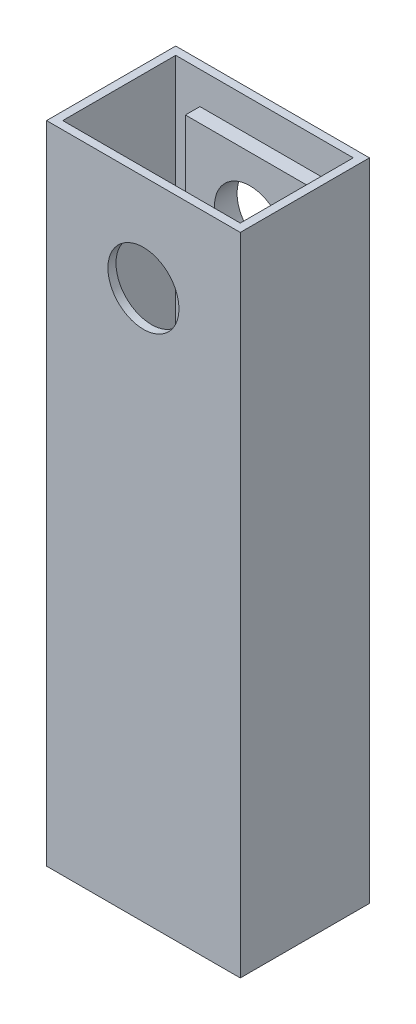
ISO-10303-21;
HEADER;
FILE_DESCRIPTION(('STEP AP214'),'2;1');
FILE_NAME('part.step','',(''),(''),'','','');
FILE_SCHEMA(('AUTOMOTIVE_DESIGN { 1 0 10303 214 1 1 1 1 }'));
ENDSEC;
DATA;
#1=APPLICATION_CONTEXT('core data for automotive mechanical design processes');
#2=APPLICATION_PROTOCOL_DEFINITION('international standard','automotive_design',2000,#1);
#3=PRODUCT_CONTEXT('',#1,'mechanical');
#4=PRODUCT('Part','Part','',(#3));
#5=PRODUCT_RELATED_PRODUCT_CATEGORY('part','',(#4));
#6=PRODUCT_DEFINITION_FORMATION('','',#4);
#7=PRODUCT_DEFINITION_CONTEXT('part definition',#1,'design');
#8=PRODUCT_DEFINITION('design','',#6,#7);
#9=PRODUCT_DEFINITION_SHAPE('','',#8);
#10=(LENGTH_UNIT() NAMED_UNIT(*) SI_UNIT(.MILLI.,.METRE.));
#11=(NAMED_UNIT(*) PLANE_ANGLE_UNIT() SI_UNIT($,.RADIAN.));
#12=(NAMED_UNIT(*) SI_UNIT($,.STERADIAN.) SOLID_ANGLE_UNIT());
#13=UNCERTAINTY_MEASURE_WITH_UNIT(LENGTH_MEASURE(1.E-05),#10,'distance_accuracy_value','');
#14=(GEOMETRIC_REPRESENTATION_CONTEXT(3) GLOBAL_UNCERTAINTY_ASSIGNED_CONTEXT((#13)) GLOBAL_UNIT_ASSIGNED_CONTEXT((#10,
#11,#12)) REPRESENTATION_CONTEXT('',''));
#15=CARTESIAN_POINT('',(0.,0.,0.));
#16=DIRECTION('',(0.,0.,1.));
#17=DIRECTION('',(1.,0.,0.));
#18=AXIS2_PLACEMENT_3D('',#15,#16,#17);
#19=CARTESIAN_POINT('',(-2.5,200.,2.5));
#20=DIRECTION('',(0.,0.,1.));
#21=DIRECTION('',(1.,0.,0.));
#22=AXIS2_PLACEMENT_3D('',#19,#20,#21);
#23=PLANE('',#22);
#24=DIRECTION('',(-1.,0.,0.));
#25=VECTOR('',#24,1.);
#26=CARTESIAN_POINT('',(-2.5,0.,2.5));
#27=LINE('',#26,#25);
#28=CARTESIAN_POINT('',(-2.5,0.,2.5));
#29=VERTEX_POINT('',#28);
#30=CARTESIAN_POINT('',(-57.5,0.,2.5));
#31=VERTEX_POINT('',#30);
#32=EDGE_CURVE('E172',#29,#31,#27,.T.);
#33=ORIENTED_EDGE('',*,*,#32,.F.);
#34=DIRECTION('',(0.,-1.,0.));
#35=VECTOR('',#34,1.);
#36=CARTESIAN_POINT('',(-2.5,200.,2.5));
#37=LINE('',#36,#35);
#38=CARTESIAN_POINT('',(-2.5,200.,2.5));
#39=VERTEX_POINT('',#38);
#40=EDGE_CURVE('E185',#39,#29,#37,.T.);
#41=ORIENTED_EDGE('',*,*,#40,.F.);
#42=DIRECTION('',(-1.,0.,0.));
#43=VECTOR('',#42,1.);
#44=CARTESIAN_POINT('',(-2.5,200.,2.5));
#45=LINE('',#44,#43);
#46=CARTESIAN_POINT('',(-57.5,200.,2.5));
#47=VERTEX_POINT('',#46);
#48=EDGE_CURVE('E162',#39,#47,#45,.T.);
#49=ORIENTED_EDGE('',*,*,#48,.T.);
#50=DIRECTION('',(0.,-1.,0.));
#51=VECTOR('',#50,1.);
#52=CARTESIAN_POINT('',(-57.5,200.,2.5));
#53=LINE('',#52,#51);
#54=EDGE_CURVE('E183',#47,#31,#53,.T.);
#55=ORIENTED_EDGE('',*,*,#54,.T.);
#56=EDGE_LOOP('',(#33,#41,#49,#55));
#57=FACE_BOUND('',#56,.T.);
#58=DIRECTION('',(1.,0.,0.));
#59=VECTOR('',#58,1.);
#60=CARTESIAN_POINT('',(-10.,150.,2.5));
#61=LINE('',#60,#59);
#62=CARTESIAN_POINT('',(-50.,150.,2.5));
#63=VERTEX_POINT('',#62);
#64=CARTESIAN_POINT('',(-10.,150.,2.5));
#65=VERTEX_POINT('',#64);
#66=EDGE_CURVE('E407',#63,#65,#61,.T.);
#67=ORIENTED_EDGE('',*,*,#66,.F.);
#68=DIRECTION('',(0.,-1.,0.));
#69=VECTOR('',#68,1.);
#70=CARTESIAN_POINT('',(-50.,150.,2.5));
#71=LINE('',#70,#69);
#72=CARTESIAN_POINT('',(-50.,190.,2.5));
#73=VERTEX_POINT('',#72);
#74=EDGE_CURVE('E147',#73,#63,#71,.T.);
#75=ORIENTED_EDGE('',*,*,#74,.F.);
#76=DIRECTION('',(-1.,0.,0.));
#77=VECTOR('',#76,1.);
#78=CARTESIAN_POINT('',(-10.,190.,2.5));
#79=LINE('',#78,#77);
#80=CARTESIAN_POINT('',(-10.,190.,2.5));
#81=VERTEX_POINT('',#80);
#82=EDGE_CURVE('E143',#81,#73,#79,.T.);
#83=ORIENTED_EDGE('',*,*,#82,.F.);
#84=DIRECTION('',(0.,1.,0.));
#85=VECTOR('',#84,1.);
#86=CARTESIAN_POINT('',(-10.,150.,2.5));
#87=LINE('',#86,#85);
#88=EDGE_CURVE('E404',#65,#81,#87,.T.);
#89=ORIENTED_EDGE('',*,*,#88,.F.);
#90=EDGE_LOOP('',(#67,#75,#83,#89));
#91=FACE_BOUND('',#90,.T.);
#92=ADVANCED_FACE('F33',(#57,#91),#23,.T.);
#93=CARTESIAN_POINT('',(0.,200.,0.));
#94=DIRECTION('',(0.,-1.,0.));
#95=DIRECTION('',(0.,0.,-1.));
#96=AXIS2_PLACEMENT_3D('',#93,#94,#95);
#97=PLANE('',#96);
#98=DIRECTION('',(0.,0.,-1.));
#99=VECTOR('',#98,1.);
#100=CARTESIAN_POINT('',(0.,200.,0.));
#101=LINE('',#100,#99);
#102=CARTESIAN_POINT('',(0.,200.,40.));
#103=VERTEX_POINT('',#102);
#104=CARTESIAN_POINT('',(0.,200.,0.));
#105=VERTEX_POINT('',#104);
#106=EDGE_CURVE('E189',#103,#105,#101,.T.);
#107=ORIENTED_EDGE('',*,*,#106,.T.);
#108=DIRECTION('',(-1.,0.,0.));
#109=VECTOR('',#108,1.);
#110=CARTESIAN_POINT('',(0.,200.,0.));
#111=LINE('',#110,#109);
#112=CARTESIAN_POINT('',(-60.,200.,0.));
#113=VERTEX_POINT('',#112);
#114=EDGE_CURVE('E192',#105,#113,#111,.T.);
#115=ORIENTED_EDGE('',*,*,#114,.T.);
#116=DIRECTION('',(0.,0.,1.));
#117=VECTOR('',#116,1.);
#118=CARTESIAN_POINT('',(-60.,200.,0.));
#119=LINE('',#118,#117);
#120=CARTESIAN_POINT('',(-60.,200.,40.));
#121=VERTEX_POINT('',#120);
#122=EDGE_CURVE('E195',#113,#121,#119,.T.);
#123=ORIENTED_EDGE('',*,*,#122,.T.);
#124=DIRECTION('',(1.,0.,0.));
#125=VECTOR('',#124,1.);
#126=CARTESIAN_POINT('',(0.,200.,40.));
#127=LINE('',#126,#125);
#128=EDGE_CURVE('E197',#121,#103,#127,.T.);
#129=ORIENTED_EDGE('',*,*,#128,.T.);
#130=EDGE_LOOP('',(#107,#115,#123,#129));
#131=FACE_BOUND('',#130,.T.);
#132=DIRECTION('',(0.,0.,-1.));
#133=VECTOR('',#132,1.);
#134=CARTESIAN_POINT('',(-2.5,200.,2.5));
#135=LINE('',#134,#133);
#136=CARTESIAN_POINT('',(-2.5,200.,37.5));
#137=VERTEX_POINT('',#136);
#138=EDGE_CURVE('E160',#137,#39,#135,.T.);
#139=ORIENTED_EDGE('',*,*,#138,.F.);
#140=DIRECTION('',(1.,0.,0.));
#141=VECTOR('',#140,1.);
#142=CARTESIAN_POINT('',(-2.5,200.,37.5));
#143=LINE('',#142,#141);
#144=CARTESIAN_POINT('',(-57.5,200.,37.5));
#145=VERTEX_POINT('',#144);
#146=EDGE_CURVE('E167',#145,#137,#143,.T.);
#147=ORIENTED_EDGE('',*,*,#146,.F.);
#148=DIRECTION('',(0.,0.,1.));
#149=VECTOR('',#148,1.);
#150=CARTESIAN_POINT('',(-57.5,200.,2.5));
#151=LINE('',#150,#149);
#152=EDGE_CURVE('E165',#47,#145,#151,.T.);
#153=ORIENTED_EDGE('',*,*,#152,.F.);
#154=ORIENTED_EDGE('',*,*,#48,.F.);
#155=EDGE_LOOP('',(#139,#147,#153,#154));
#156=FACE_BOUND('',#155,.T.);
#157=ADVANCED_FACE('F233',(#131,#156),#97,.F.);
#158=CARTESIAN_POINT('',(0.,0.,0.));
#159=DIRECTION('',(0.,-1.,0.));
#160=DIRECTION('',(0.,0.,-1.));
#161=AXIS2_PLACEMENT_3D('',#158,#159,#160);
#162=PLANE('',#161);
#163=DIRECTION('',(0.,0.,-1.));
#164=VECTOR('',#163,1.);
#165=CARTESIAN_POINT('',(0.,0.,0.));
#166=LINE('',#165,#164);
#167=CARTESIAN_POINT('',(0.,0.,40.));
#168=VERTEX_POINT('',#167);
#169=CARTESIAN_POINT('',(0.,0.,0.));
#170=VERTEX_POINT('',#169);
#171=EDGE_CURVE('E188',#168,#170,#166,.T.);
#172=ORIENTED_EDGE('',*,*,#171,.F.);
#173=DIRECTION('',(1.,0.,0.));
#174=VECTOR('',#173,1.);
#175=CARTESIAN_POINT('',(0.,0.,40.));
#176=LINE('',#175,#174);
#177=CARTESIAN_POINT('',(-60.,0.,40.));
#178=VERTEX_POINT('',#177);
#179=EDGE_CURVE('E193',#178,#168,#176,.T.);
#180=ORIENTED_EDGE('',*,*,#179,.F.);
#181=DIRECTION('',(0.,0.,1.));
#182=VECTOR('',#181,1.);
#183=CARTESIAN_POINT('',(-60.,0.,0.));
#184=LINE('',#183,#182);
#185=CARTESIAN_POINT('',(-60.,0.,0.));
#186=VERTEX_POINT('',#185);
#187=EDGE_CURVE('E204',#186,#178,#184,.T.);
#188=ORIENTED_EDGE('',*,*,#187,.F.);
#189=DIRECTION('',(-1.,0.,0.));
#190=VECTOR('',#189,1.);
#191=CARTESIAN_POINT('',(0.,0.,0.));
#192=LINE('',#191,#190);
#193=EDGE_CURVE('E202',#170,#186,#192,.T.);
#194=ORIENTED_EDGE('',*,*,#193,.F.);
#195=EDGE_LOOP('',(#172,#180,#188,#194));
#196=FACE_BOUND('',#195,.T.);
#197=DIRECTION('',(1.,0.,0.));
#198=VECTOR('',#197,1.);
#199=CARTESIAN_POINT('',(-2.5,0.,37.5));
#200=LINE('',#199,#198);
#201=CARTESIAN_POINT('',(-57.5,0.,37.5));
#202=VERTEX_POINT('',#201);
#203=CARTESIAN_POINT('',(-2.5,0.,37.5));
#204=VERTEX_POINT('',#203);
#205=EDGE_CURVE('E163',#202,#204,#200,.T.);
#206=ORIENTED_EDGE('',*,*,#205,.T.);
#207=DIRECTION('',(0.,0.,-1.));
#208=VECTOR('',#207,1.);
#209=CARTESIAN_POINT('',(-2.5,0.,2.5));
#210=LINE('',#209,#208);
#211=EDGE_CURVE('E159',#204,#29,#210,.T.);
#212=ORIENTED_EDGE('',*,*,#211,.T.);
#213=ORIENTED_EDGE('',*,*,#32,.T.);
#214=DIRECTION('',(0.,0.,1.));
#215=VECTOR('',#214,1.);
#216=CARTESIAN_POINT('',(-57.5,0.,2.5));
#217=LINE('',#216,#215);
#218=EDGE_CURVE('E175',#31,#202,#217,.T.);
#219=ORIENTED_EDGE('',*,*,#218,.T.);
#220=EDGE_LOOP('',(#206,#212,#213,#219));
#221=FACE_BOUND('',#220,.T.);
#222=ADVANCED_FACE('F223',(#196,#221),#162,.T.);
#223=CARTESIAN_POINT('',(0.,200.,0.));
#224=DIRECTION('',(-1.,0.,0.));
#225=DIRECTION('',(0.,0.,1.));
#226=AXIS2_PLACEMENT_3D('',#223,#224,#225);
#227=PLANE('',#226);
#228=ORIENTED_EDGE('',*,*,#171,.T.);
#229=DIRECTION('',(0.,-1.,0.));
#230=VECTOR('',#229,1.);
#231=CARTESIAN_POINT('',(0.,200.,0.));
#232=LINE('',#231,#230);
#233=EDGE_CURVE('E11',#105,#170,#232,.T.);
#234=ORIENTED_EDGE('',*,*,#233,.F.);
#235=ORIENTED_EDGE('',*,*,#106,.F.);
#236=DIRECTION('',(0.,-1.,0.));
#237=VECTOR('',#236,1.);
#238=CARTESIAN_POINT('',(0.,200.,40.));
#239=LINE('',#238,#237);
#240=EDGE_CURVE('E199',#103,#168,#239,.T.);
#241=ORIENTED_EDGE('',*,*,#240,.T.);
#242=EDGE_LOOP('',(#228,#234,#235,#241));
#243=FACE_BOUND('',#242,.T.);
#244=ADVANCED_FACE('F35',(#243),#227,.F.);
#245=CARTESIAN_POINT('',(0.,200.,0.));
#246=DIRECTION('',(0.,0.,1.));
#247=DIRECTION('',(1.,0.,0.));
#248=AXIS2_PLACEMENT_3D('',#245,#246,#247);
#249=PLANE('',#248);
#250=CARTESIAN_POINT('',(-30.,170.,0.));
#251=DIRECTION('',(0.,0.,-1.));
#252=DIRECTION('',(-1.,0.,0.));
#253=AXIS2_PLACEMENT_3D('',#250,#251,#252);
#254=CIRCLE('',#253,11.);
#255=CARTESIAN_POINT('',(-41.,170.,0.));
#256=VERTEX_POINT('',#255);
#257=EDGE_CURVE('E149',#256,#256,#254,.T.);
#258=ORIENTED_EDGE('',*,*,#257,.F.);
#259=EDGE_LOOP('',(#258));
#260=FACE_BOUND('',#259,.T.);
#261=ORIENTED_EDGE('',*,*,#193,.T.);
#262=DIRECTION('',(0.,-1.,0.));
#263=VECTOR('',#262,1.);
#264=CARTESIAN_POINT('',(-60.,200.,0.));
#265=LINE('',#264,#263);
#266=EDGE_CURVE('E42',#113,#186,#265,.T.);
#267=ORIENTED_EDGE('',*,*,#266,.F.);
#268=ORIENTED_EDGE('',*,*,#114,.F.);
#269=ORIENTED_EDGE('',*,*,#233,.T.);
#270=EDGE_LOOP('',(#261,#267,#268,#269));
#271=FACE_BOUND('',#270,.T.);
#272=ADVANCED_FACE('F235',(#260,#271),#249,.F.);
#273=CARTESIAN_POINT('',(-60.,200.,0.));
#274=DIRECTION('',(1.,0.,0.));
#275=DIRECTION('',(0.,0.,-1.));
#276=AXIS2_PLACEMENT_3D('',#273,#274,#275);
#277=PLANE('',#276);
#278=ORIENTED_EDGE('',*,*,#187,.T.);
#279=DIRECTION('',(0.,-1.,0.));
#280=VECTOR('',#279,1.);
#281=CARTESIAN_POINT('',(-60.,200.,40.));
#282=LINE('',#281,#280);
#283=EDGE_CURVE('E209',#121,#178,#282,.T.);
#284=ORIENTED_EDGE('',*,*,#283,.F.);
#285=ORIENTED_EDGE('',*,*,#122,.F.);
#286=ORIENTED_EDGE('',*,*,#266,.T.);
#287=EDGE_LOOP('',(#278,#284,#285,#286));
#288=FACE_BOUND('',#287,.T.);
#289=ADVANCED_FACE('F217',(#288),#277,.F.);
#290=CARTESIAN_POINT('',(0.,200.,40.));
#291=DIRECTION('',(0.,0.,-1.));
#292=DIRECTION('',(-1.,0.,0.));
#293=AXIS2_PLACEMENT_3D('',#290,#291,#292);
#294=PLANE('',#293);
#295=CARTESIAN_POINT('',(-30.,170.,40.));
#296=DIRECTION('',(0.,0.,-1.));
#297=DIRECTION('',(-1.,0.,0.));
#298=AXIS2_PLACEMENT_3D('',#295,#296,#297);
#299=CIRCLE('',#298,11.);
#300=CARTESIAN_POINT('',(-41.,170.,40.));
#301=VERTEX_POINT('',#300);
#302=EDGE_CURVE('E156',#301,#301,#299,.T.);
#303=ORIENTED_EDGE('',*,*,#302,.T.);
#304=EDGE_LOOP('',(#303));
#305=FACE_BOUND('',#304,.T.);
#306=ORIENTED_EDGE('',*,*,#179,.T.);
#307=ORIENTED_EDGE('',*,*,#240,.F.);
#308=ORIENTED_EDGE('',*,*,#128,.F.);
#309=ORIENTED_EDGE('',*,*,#283,.T.);
#310=EDGE_LOOP('',(#306,#307,#308,#309));
#311=FACE_BOUND('',#310,.T.);
#312=ADVANCED_FACE('F227',(#305,#311),#294,.F.);
#313=CARTESIAN_POINT('',(-2.5,200.,2.5));
#314=DIRECTION('',(-1.,0.,0.));
#315=DIRECTION('',(0.,0.,1.));
#316=AXIS2_PLACEMENT_3D('',#313,#314,#315);
#317=PLANE('',#316);
#318=ORIENTED_EDGE('',*,*,#211,.F.);
#319=DIRECTION('',(0.,-1.,0.));
#320=VECTOR('',#319,1.);
#321=CARTESIAN_POINT('',(-2.5,200.,37.5));
#322=LINE('',#321,#320);
#323=EDGE_CURVE('E169',#137,#204,#322,.T.);
#324=ORIENTED_EDGE('',*,*,#323,.F.);
#325=ORIENTED_EDGE('',*,*,#138,.T.);
#326=ORIENTED_EDGE('',*,*,#40,.T.);
#327=EDGE_LOOP('',(#318,#324,#325,#326));
#328=FACE_BOUND('',#327,.T.);
#329=ADVANCED_FACE('F260',(#328),#317,.T.);
#330=CARTESIAN_POINT('',(-57.5,200.,2.5));
#331=DIRECTION('',(1.,0.,0.));
#332=DIRECTION('',(0.,0.,-1.));
#333=AXIS2_PLACEMENT_3D('',#330,#331,#332);
#334=PLANE('',#333);
#335=ORIENTED_EDGE('',*,*,#218,.F.);
#336=ORIENTED_EDGE('',*,*,#54,.F.);
#337=ORIENTED_EDGE('',*,*,#152,.T.);
#338=DIRECTION('',(0.,-1.,0.));
#339=VECTOR('',#338,1.);
#340=CARTESIAN_POINT('',(-57.5,200.,37.5));
#341=LINE('',#340,#339);
#342=EDGE_CURVE('E57',#145,#202,#341,.T.);
#343=ORIENTED_EDGE('',*,*,#342,.T.);
#344=EDGE_LOOP('',(#335,#336,#337,#343));
#345=FACE_BOUND('',#344,.T.);
#346=ADVANCED_FACE('F258',(#345),#334,.T.);
#347=CARTESIAN_POINT('',(-2.5,200.,37.5));
#348=DIRECTION('',(0.,0.,-1.));
#349=DIRECTION('',(-1.,0.,0.));
#350=AXIS2_PLACEMENT_3D('',#347,#348,#349);
#351=PLANE('',#350);
#352=CARTESIAN_POINT('',(-30.,170.,37.5));
#353=DIRECTION('',(0.,0.,-1.));
#354=DIRECTION('',(-1.,0.,0.));
#355=AXIS2_PLACEMENT_3D('',#352,#353,#354);
#356=CIRCLE('',#355,11.);
#357=CARTESIAN_POINT('',(-41.,170.,37.5));
#358=VERTEX_POINT('',#357);
#359=EDGE_CURVE('E37',#358,#358,#356,.T.);
#360=ORIENTED_EDGE('',*,*,#359,.F.);
#361=EDGE_LOOP('',(#360));
#362=FACE_BOUND('',#361,.T.);
#363=ORIENTED_EDGE('',*,*,#205,.F.);
#364=ORIENTED_EDGE('',*,*,#342,.F.);
#365=ORIENTED_EDGE('',*,*,#146,.T.);
#366=ORIENTED_EDGE('',*,*,#323,.T.);
#367=EDGE_LOOP('',(#363,#364,#365,#366));
#368=FACE_BOUND('',#367,.T.);
#369=ADVANCED_FACE('F275',(#362,#368),#351,.T.);
#370=CARTESIAN_POINT('',(-30.,170.,200.));
#371=DIRECTION('',(0.,0.,-1.));
#372=DIRECTION('',(-1.,0.,0.));
#373=AXIS2_PLACEMENT_3D('',#370,#371,#372);
#374=CYLINDRICAL_SURFACE('',#373,11.);
#375=ORIENTED_EDGE('',*,*,#359,.T.);
#376=EDGE_LOOP('',(#375));
#377=FACE_BOUND('',#376,.T.);
#378=ORIENTED_EDGE('',*,*,#302,.F.);
#379=EDGE_LOOP('',(#378));
#380=FACE_BOUND('',#379,.T.);
#381=ADVANCED_FACE('F272',(#377,#380),#374,.F.);
#382=ORIENTED_EDGE('',*,*,#257,.T.);
#383=EDGE_LOOP('',(#382));
#384=FACE_BOUND('',#383,.T.);
#385=CARTESIAN_POINT('',(-30.,170.,7.));
#386=DIRECTION('',(0.,0.,1.));
#387=DIRECTION('',(1.,0.,0.));
#388=AXIS2_PLACEMENT_3D('',#385,#386,#387);
#389=CIRCLE('',#388,11.);
#390=CARTESIAN_POINT('',(-19.,170.,7.));
#391=VERTEX_POINT('',#390);
#392=EDGE_CURVE('E408',#391,#391,#389,.T.);
#393=ORIENTED_EDGE('',*,*,#392,.T.);
#394=EDGE_LOOP('',(#393));
#395=FACE_BOUND('',#394,.T.);
#396=ADVANCED_FACE('F274',(#384,#395),#374,.F.);
#397=CARTESIAN_POINT('',(0.,0.,7.));
#398=DIRECTION('',(0.,0.,1.));
#399=DIRECTION('',(1.,0.,0.));
#400=AXIS2_PLACEMENT_3D('',#397,#398,#399);
#401=PLANE('',#400);
#402=DIRECTION('',(0.,-1.,0.));
#403=VECTOR('',#402,1.);
#404=CARTESIAN_POINT('',(-50.,150.,7.));
#405=LINE('',#404,#403);
#406=CARTESIAN_POINT('',(-50.,190.,7.));
#407=VERTEX_POINT('',#406);
#408=CARTESIAN_POINT('',(-50.,150.,7.));
#409=VERTEX_POINT('',#408);
#410=EDGE_CURVE('E134',#407,#409,#405,.T.);
#411=ORIENTED_EDGE('',*,*,#410,.T.);
#412=DIRECTION('',(1.,0.,0.));
#413=VECTOR('',#412,1.);
#414=CARTESIAN_POINT('',(-10.,150.,7.));
#415=LINE('',#414,#413);
#416=CARTESIAN_POINT('',(-10.,150.,7.));
#417=VERTEX_POINT('',#416);
#418=EDGE_CURVE('E123',#409,#417,#415,.T.);
#419=ORIENTED_EDGE('',*,*,#418,.T.);
#420=DIRECTION('',(0.,1.,0.));
#421=VECTOR('',#420,1.);
#422=CARTESIAN_POINT('',(-10.,150.,7.));
#423=LINE('',#422,#421);
#424=CARTESIAN_POINT('',(-10.,190.,7.));
#425=VERTEX_POINT('',#424);
#426=EDGE_CURVE('E133',#417,#425,#423,.T.);
#427=ORIENTED_EDGE('',*,*,#426,.T.);
#428=DIRECTION('',(-1.,0.,0.));
#429=VECTOR('',#428,1.);
#430=CARTESIAN_POINT('',(-10.,190.,7.));
#431=LINE('',#430,#429);
#432=EDGE_CURVE('E139',#425,#407,#431,.T.);
#433=ORIENTED_EDGE('',*,*,#432,.T.);
#434=EDGE_LOOP('',(#411,#419,#427,#433));
#435=FACE_BOUND('',#434,.T.);
#436=ORIENTED_EDGE('',*,*,#392,.F.);
#437=EDGE_LOOP('',(#436));
#438=FACE_BOUND('',#437,.T.);
#439=ADVANCED_FACE('F137',(#435,#438),#401,.T.);
#440=CARTESIAN_POINT('',(-50.,150.,7.));
#441=DIRECTION('',(1.,0.,0.));
#442=DIRECTION('',(0.,0.,-1.));
#443=AXIS2_PLACEMENT_3D('',#440,#441,#442);
#444=PLANE('',#443);
#445=ORIENTED_EDGE('',*,*,#74,.T.);
#446=DIRECTION('',(0.,0.,-1.));
#447=VECTOR('',#446,1.);
#448=CARTESIAN_POINT('',(-50.,150.,7.));
#449=LINE('',#448,#447);
#450=EDGE_CURVE('E127',#409,#63,#449,.T.);
#451=ORIENTED_EDGE('',*,*,#450,.F.);
#452=ORIENTED_EDGE('',*,*,#410,.F.);
#453=DIRECTION('',(0.,0.,-1.));
#454=VECTOR('',#453,1.);
#455=CARTESIAN_POINT('',(-50.,190.,7.));
#456=LINE('',#455,#454);
#457=EDGE_CURVE('E402',#407,#73,#456,.T.);
#458=ORIENTED_EDGE('',*,*,#457,.T.);
#459=EDGE_LOOP('',(#445,#451,#452,#458));
#460=FACE_BOUND('',#459,.T.);
#461=ADVANCED_FACE('F145',(#460),#444,.F.);
#462=CARTESIAN_POINT('',(-10.,150.,7.));
#463=DIRECTION('',(0.,1.,0.));
#464=DIRECTION('',(0.,0.,1.));
#465=AXIS2_PLACEMENT_3D('',#462,#463,#464);
#466=PLANE('',#465);
#467=ORIENTED_EDGE('',*,*,#66,.T.);
#468=DIRECTION('',(0.,0.,-1.));
#469=VECTOR('',#468,1.);
#470=CARTESIAN_POINT('',(-10.,150.,7.));
#471=LINE('',#470,#469);
#472=EDGE_CURVE('E130',#417,#65,#471,.T.);
#473=ORIENTED_EDGE('',*,*,#472,.F.);
#474=ORIENTED_EDGE('',*,*,#418,.F.);
#475=ORIENTED_EDGE('',*,*,#450,.T.);
#476=EDGE_LOOP('',(#467,#473,#474,#475));
#477=FACE_BOUND('',#476,.T.);
#478=ADVANCED_FACE('F125',(#477),#466,.F.);
#479=CARTESIAN_POINT('',(-10.,150.,7.));
#480=DIRECTION('',(-1.,0.,0.));
#481=DIRECTION('',(0.,0.,1.));
#482=AXIS2_PLACEMENT_3D('',#479,#480,#481);
#483=PLANE('',#482);
#484=ORIENTED_EDGE('',*,*,#88,.T.);
#485=DIRECTION('',(0.,0.,-1.));
#486=VECTOR('',#485,1.);
#487=CARTESIAN_POINT('',(-10.,190.,7.));
#488=LINE('',#487,#486);
#489=EDGE_CURVE('E49',#425,#81,#488,.T.);
#490=ORIENTED_EDGE('',*,*,#489,.F.);
#491=ORIENTED_EDGE('',*,*,#426,.F.);
#492=ORIENTED_EDGE('',*,*,#472,.T.);
#493=EDGE_LOOP('',(#484,#490,#491,#492));
#494=FACE_BOUND('',#493,.T.);
#495=ADVANCED_FACE('F289',(#494),#483,.F.);
#496=CARTESIAN_POINT('',(-10.,190.,7.));
#497=DIRECTION('',(0.,-1.,0.));
#498=DIRECTION('',(0.,0.,-1.));
#499=AXIS2_PLACEMENT_3D('',#496,#497,#498);
#500=PLANE('',#499);
#501=ORIENTED_EDGE('',*,*,#82,.T.);
#502=ORIENTED_EDGE('',*,*,#457,.F.);
#503=ORIENTED_EDGE('',*,*,#432,.F.);
#504=ORIENTED_EDGE('',*,*,#489,.T.);
#505=EDGE_LOOP('',(#501,#502,#503,#504));
#506=FACE_BOUND('',#505,.T.);
#507=ADVANCED_FACE('F292',(#506),#500,.F.);
#508=CLOSED_SHELL('',(#92,#157,#222,#244,#272,#289,#312,#329,#346,#369,#381,#396,#439,#461,#478,
#495,#507));
#509=MANIFOLD_SOLID_BREP('B2',#508);
#510=ADVANCED_BREP_SHAPE_REPRESENTATION('',(#18,#509),#14);
#511=SHAPE_DEFINITION_REPRESENTATION(#9,#510);
ENDSEC;
END-ISO-10303-21;
